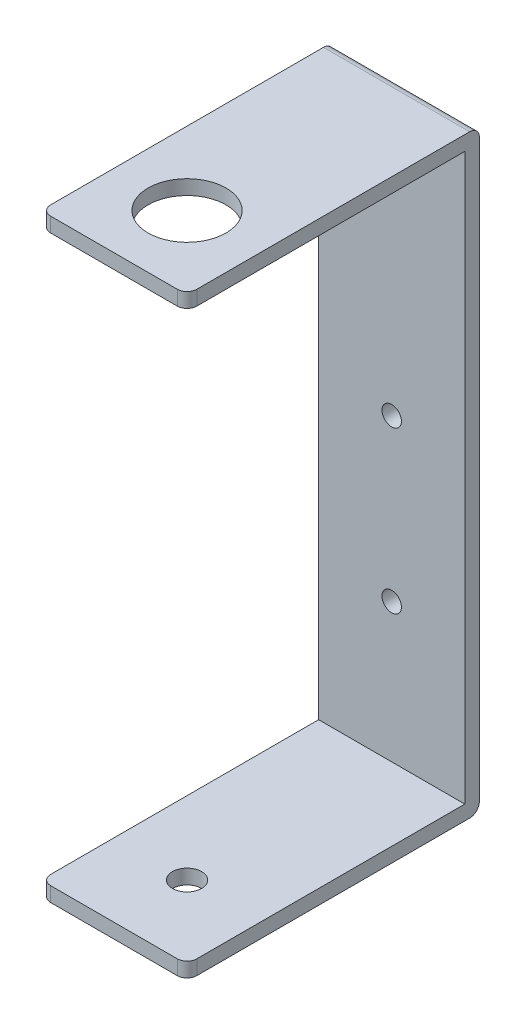
ISO-10303-21;
HEADER;
FILE_DESCRIPTION(('STEP AP214'),'2;1');
FILE_NAME('part.step','',(''),(''),'','','');
FILE_SCHEMA(('AUTOMOTIVE_DESIGN { 1 0 10303 214 1 1 1 1 }'));
ENDSEC;
DATA;
#1=APPLICATION_CONTEXT('core data for automotive mechanical design processes');
#2=APPLICATION_PROTOCOL_DEFINITION('international standard','automotive_design',2000,#1);
#3=PRODUCT_CONTEXT('',#1,'mechanical');
#4=PRODUCT('Part','Part','',(#3));
#5=PRODUCT_RELATED_PRODUCT_CATEGORY('part','',(#4));
#6=PRODUCT_DEFINITION_FORMATION('','',#4);
#7=PRODUCT_DEFINITION_CONTEXT('part definition',#1,'design');
#8=PRODUCT_DEFINITION('design','',#6,#7);
#9=PRODUCT_DEFINITION_SHAPE('','',#8);
#10=(LENGTH_UNIT() NAMED_UNIT(*) SI_UNIT(.MILLI.,.METRE.));
#11=(NAMED_UNIT(*) PLANE_ANGLE_UNIT() SI_UNIT($,.RADIAN.));
#12=(NAMED_UNIT(*) SI_UNIT($,.STERADIAN.) SOLID_ANGLE_UNIT());
#13=UNCERTAINTY_MEASURE_WITH_UNIT(LENGTH_MEASURE(1.E-05),#10,'distance_accuracy_value','');
#14=(GEOMETRIC_REPRESENTATION_CONTEXT(3) GLOBAL_UNCERTAINTY_ASSIGNED_CONTEXT((#13)) GLOBAL_UNIT_ASSIGNED_CONTEXT((#10,
#11,#12)) REPRESENTATION_CONTEXT('',''));
#15=CARTESIAN_POINT('',(0.,0.,0.));
#16=DIRECTION('',(0.,0.,1.));
#17=DIRECTION('',(1.,0.,0.));
#18=AXIS2_PLACEMENT_3D('',#15,#16,#17);
#19=CARTESIAN_POINT('',(0.,0.,1.5));
#20=DIRECTION('',(0.,0.,1.));
#21=DIRECTION('',(1.,0.,0.));
#22=AXIS2_PLACEMENT_3D('',#19,#20,#21);
#23=PLANE('',#22);
#24=CARTESIAN_POINT('',(0.,1.76200000000001,1.5));
#25=DIRECTION('',(0.,0.,1.));
#26=DIRECTION('',(1.,0.,0.));
#27=AXIS2_PLACEMENT_3D('',#24,#25,#26);
#28=CIRCLE('',#27,1.);
#29=CARTESIAN_POINT('',(1.,1.76200000000001,1.5));
#30=VERTEX_POINT('',#29);
#31=EDGE_CURVE('E257',#30,#30,#28,.T.);
#32=ORIENTED_EDGE('',*,*,#31,.F.);
#33=EDGE_LOOP('',(#32));
#34=FACE_BOUND('',#33,.T.);
#35=CARTESIAN_POINT('',(0.,-14.75,1.5));
#36=DIRECTION('',(0.,0.,1.));
#37=DIRECTION('',(1.,0.,0.));
#38=AXIS2_PLACEMENT_3D('',#35,#36,#37);
#39=CIRCLE('',#38,1.);
#40=CARTESIAN_POINT('',(1.,-14.75,1.5));
#41=VERTEX_POINT('',#40);
#42=EDGE_CURVE('E246',#41,#41,#39,.T.);
#43=ORIENTED_EDGE('',*,*,#42,.F.);
#44=EDGE_LOOP('',(#43));
#45=FACE_BOUND('',#44,.T.);
#46=DIRECTION('',(0.,1.,0.));
#47=VECTOR('',#46,1.);
#48=CARTESIAN_POINT('',(-7.5,0.,1.5));
#49=LINE('',#48,#47);
#50=CARTESIAN_POINT('',(-7.49999999999999,-29.,1.5));
#51=VERTEX_POINT('',#50);
#52=CARTESIAN_POINT('',(-7.5,29.,1.5));
#53=VERTEX_POINT('',#52);
#54=EDGE_CURVE('E161',#51,#53,#49,.T.);
#55=ORIENTED_EDGE('',*,*,#54,.F.);
#56=DIRECTION('',(-1.,0.,0.));
#57=VECTOR('',#56,1.);
#58=CARTESIAN_POINT('',(7.5,-29.,1.5));
#59=LINE('',#58,#57);
#60=CARTESIAN_POINT('',(7.5,-29.,1.5));
#61=VERTEX_POINT('',#60);
#62=EDGE_CURVE('E160',#61,#51,#59,.T.);
#63=ORIENTED_EDGE('',*,*,#62,.F.);
#64=DIRECTION('',(0.,1.,0.));
#65=VECTOR('',#64,1.);
#66=CARTESIAN_POINT('',(7.5,0.,1.5));
#67=LINE('',#66,#65);
#68=CARTESIAN_POINT('',(7.5,29.,1.5));
#69=VERTEX_POINT('',#68);
#70=EDGE_CURVE('E145',#61,#69,#67,.T.);
#71=ORIENTED_EDGE('',*,*,#70,.T.);
#72=DIRECTION('',(1.,0.,0.));
#73=VECTOR('',#72,1.);
#74=CARTESIAN_POINT('',(-7.49999999999999,29.,1.5));
#75=LINE('',#74,#73);
#76=EDGE_CURVE('E158',#53,#69,#75,.T.);
#77=ORIENTED_EDGE('',*,*,#76,.F.);
#78=EDGE_LOOP('',(#55,#63,#71,#77));
#79=FACE_BOUND('',#78,.T.);
#80=ADVANCED_FACE('F35',(#34,#45,#79),#23,.T.);
#81=CARTESIAN_POINT('',(0.,-30.5,1.5));
#82=DIRECTION('',(0.,1.,0.));
#83=DIRECTION('',(-1.,0.,0.));
#84=AXIS2_PLACEMENT_3D('',#81,#82,#83);
#85=PLANE('',#84);
#86=CARTESIAN_POINT('',(0.,-30.5,22.5));
#87=DIRECTION('',(0.,1.,0.));
#88=DIRECTION('',(0.,0.,1.));
#89=AXIS2_PLACEMENT_3D('',#86,#87,#88);
#90=CIRCLE('',#89,1.5);
#91=CARTESIAN_POINT('',(0.,-30.5,24.));
#92=VERTEX_POINT('',#91);
#93=EDGE_CURVE('E193',#92,#92,#90,.T.);
#94=ORIENTED_EDGE('',*,*,#93,.T.);
#95=EDGE_LOOP('',(#94));
#96=FACE_BOUND('',#95,.T.);
#97=DIRECTION('',(0.,0.,-1.));
#98=VECTOR('',#97,1.);
#99=CARTESIAN_POINT('',(-7.49999999999999,-30.5,1.5));
#100=LINE('',#99,#98);
#101=CARTESIAN_POINT('',(-7.49999999999999,-30.5,29.));
#102=VERTEX_POINT('',#101);
#103=CARTESIAN_POINT('',(-7.49999999999999,-30.5,1.));
#104=VERTEX_POINT('',#103);
#105=EDGE_CURVE('E279',#102,#104,#100,.T.);
#106=ORIENTED_EDGE('',*,*,#105,.T.);
#107=DIRECTION('',(1.,0.,0.));
#108=VECTOR('',#107,1.);
#109=CARTESIAN_POINT('',(0.,-30.5,1.));
#110=LINE('',#109,#108);
#111=CARTESIAN_POINT('',(7.5,-30.5,1.));
#112=VERTEX_POINT('',#111);
#113=EDGE_CURVE('E198',#104,#112,#110,.T.);
#114=ORIENTED_EDGE('',*,*,#113,.T.);
#115=DIRECTION('',(0.,0.,-1.));
#116=VECTOR('',#115,1.);
#117=CARTESIAN_POINT('',(7.5,-30.5,1.5));
#118=LINE('',#117,#116);
#119=CARTESIAN_POINT('',(7.5,-30.5,29.));
#120=VERTEX_POINT('',#119);
#121=EDGE_CURVE('E177',#120,#112,#118,.T.);
#122=ORIENTED_EDGE('',*,*,#121,.F.);
#123=CARTESIAN_POINT('',(6.5,-30.5,29.));
#124=DIRECTION('',(0.,1.,0.));
#125=DIRECTION('',(-1.,0.,0.));
#126=AXIS2_PLACEMENT_3D('',#123,#124,#125);
#127=CIRCLE('',#126,1.);
#128=CARTESIAN_POINT('',(6.5,-30.5,30.));
#129=VERTEX_POINT('',#128);
#130=EDGE_CURVE('E194',#120,#129,#127,.F.);
#131=ORIENTED_EDGE('',*,*,#130,.T.);
#132=DIRECTION('',(1.,0.,0.));
#133=VECTOR('',#132,1.);
#134=CARTESIAN_POINT('',(7.5,-30.5,30.));
#135=LINE('',#134,#133);
#136=CARTESIAN_POINT('',(-6.49999999999999,-30.5,30.));
#137=VERTEX_POINT('',#136);
#138=EDGE_CURVE('E267',#137,#129,#135,.T.);
#139=ORIENTED_EDGE('',*,*,#138,.F.);
#140=CARTESIAN_POINT('',(-6.49999999999999,-30.5,29.));
#141=DIRECTION('',(0.,1.,0.));
#142=DIRECTION('',(-1.,0.,0.));
#143=AXIS2_PLACEMENT_3D('',#140,#141,#142);
#144=CIRCLE('',#143,1.);
#145=EDGE_CURVE('E196',#137,#102,#144,.F.);
#146=ORIENTED_EDGE('',*,*,#145,.T.);
#147=EDGE_LOOP('',(#106,#114,#122,#131,#139,#146));
#148=FACE_BOUND('',#147,.T.);
#149=ADVANCED_FACE('F291',(#96,#148),#85,.F.);
#150=CARTESIAN_POINT('',(7.5,0.,1.5));
#151=DIRECTION('',(-1.,0.,0.));
#152=DIRECTION('',(0.,0.,1.));
#153=AXIS2_PLACEMENT_3D('',#150,#151,#152);
#154=PLANE('',#153);
#155=ORIENTED_EDGE('',*,*,#121,.T.);
#156=CARTESIAN_POINT('',(7.5,-29.5,1.));
#157=DIRECTION('',(-1.,0.,0.));
#158=DIRECTION('',(0.,0.,1.));
#159=AXIS2_PLACEMENT_3D('',#156,#157,#158);
#160=CIRCLE('',#159,1.);
#161=CARTESIAN_POINT('',(7.5,-29.5,0.));
#162=VERTEX_POINT('',#161);
#163=EDGE_CURVE('E206',#112,#162,#160,.F.);
#164=ORIENTED_EDGE('',*,*,#163,.T.);
#165=DIRECTION('',(0.,1.,0.));
#166=VECTOR('',#165,1.);
#167=CARTESIAN_POINT('',(7.5,0.,0.));
#168=LINE('',#167,#166);
#169=CARTESIAN_POINT('',(7.5,29.5,0.));
#170=VERTEX_POINT('',#169);
#171=EDGE_CURVE('E215',#162,#170,#168,.T.);
#172=ORIENTED_EDGE('',*,*,#171,.T.);
#173=CARTESIAN_POINT('',(7.5,29.5,1.));
#174=DIRECTION('',(-1.,0.,0.));
#175=DIRECTION('',(0.,0.,1.));
#176=AXIS2_PLACEMENT_3D('',#173,#174,#175);
#177=CIRCLE('',#176,1.);
#178=CARTESIAN_POINT('',(7.5,30.5,1.));
#179=VERTEX_POINT('',#178);
#180=EDGE_CURVE('E200',#170,#179,#177,.F.);
#181=ORIENTED_EDGE('',*,*,#180,.T.);
#182=DIRECTION('',(0.,0.,-1.));
#183=VECTOR('',#182,1.);
#184=CARTESIAN_POINT('',(7.5,30.5,1.5));
#185=LINE('',#184,#183);
#186=CARTESIAN_POINT('',(7.5,30.5,29.));
#187=VERTEX_POINT('',#186);
#188=EDGE_CURVE('E302',#187,#179,#185,.T.);
#189=ORIENTED_EDGE('',*,*,#188,.F.);
#190=DIRECTION('',(0.,1.,0.));
#191=VECTOR('',#190,1.);
#192=CARTESIAN_POINT('',(7.5,29.,29.));
#193=LINE('',#192,#191);
#194=CARTESIAN_POINT('',(7.5,29.,29.));
#195=VERTEX_POINT('',#194);
#196=EDGE_CURVE('E147',#187,#195,#193,.F.);
#197=ORIENTED_EDGE('',*,*,#196,.T.);
#198=DIRECTION('',(0.,0.,-1.));
#199=VECTOR('',#198,1.);
#200=CARTESIAN_POINT('',(7.5,29.,30.));
#201=LINE('',#200,#199);
#202=EDGE_CURVE('E140',#195,#69,#201,.T.);
#203=ORIENTED_EDGE('',*,*,#202,.T.);
#204=ORIENTED_EDGE('',*,*,#70,.F.);
#205=DIRECTION('',(0.,0.,-1.));
#206=VECTOR('',#205,1.);
#207=CARTESIAN_POINT('',(7.5,-29.,30.));
#208=LINE('',#207,#206);
#209=CARTESIAN_POINT('',(7.5,-29.,29.));
#210=VERTEX_POINT('',#209);
#211=EDGE_CURVE('E168',#210,#61,#208,.T.);
#212=ORIENTED_EDGE('',*,*,#211,.F.);
#213=DIRECTION('',(0.,1.,0.));
#214=VECTOR('',#213,1.);
#215=CARTESIAN_POINT('',(7.5,-30.5,29.));
#216=LINE('',#215,#214);
#217=EDGE_CURVE('E204',#210,#120,#216,.F.);
#218=ORIENTED_EDGE('',*,*,#217,.T.);
#219=EDGE_LOOP('',(#155,#164,#172,#181,#189,#197,#203,#204,#212,#218));
#220=FACE_BOUND('',#219,.T.);
#221=ADVANCED_FACE('F143',(#220),#154,.F.);
#222=CARTESIAN_POINT('',(0.,30.5,1.5));
#223=DIRECTION('',(0.,1.,0.));
#224=DIRECTION('',(0.,0.,1.));
#225=AXIS2_PLACEMENT_3D('',#222,#223,#224);
#226=PLANE('',#225);
#227=CARTESIAN_POINT('',(0.,30.5,22.5));
#228=DIRECTION('',(0.,1.,0.));
#229=DIRECTION('',(0.,0.,1.));
#230=AXIS2_PLACEMENT_3D('',#227,#228,#229);
#231=CIRCLE('',#230,4.);
#232=CARTESIAN_POINT('',(0.,30.5,26.5));
#233=VERTEX_POINT('',#232);
#234=EDGE_CURVE('E245',#233,#233,#231,.T.);
#235=ORIENTED_EDGE('',*,*,#234,.F.);
#236=EDGE_LOOP('',(#235));
#237=FACE_BOUND('',#236,.T.);
#238=DIRECTION('',(-1.,0.,0.));
#239=VECTOR('',#238,1.);
#240=CARTESIAN_POINT('',(-7.5,30.5,30.));
#241=LINE('',#240,#239);
#242=CARTESIAN_POINT('',(6.49999999999999,30.5,30.));
#243=VERTEX_POINT('',#242);
#244=CARTESIAN_POINT('',(-6.5,30.5,30.));
#245=VERTEX_POINT('',#244);
#246=EDGE_CURVE('E152',#243,#245,#241,.T.);
#247=ORIENTED_EDGE('',*,*,#246,.F.);
#248=CARTESIAN_POINT('',(6.5,30.5,29.));
#249=DIRECTION('',(0.,1.,0.));
#250=DIRECTION('',(0.,0.,1.));
#251=AXIS2_PLACEMENT_3D('',#248,#249,#250);
#252=CIRCLE('',#251,1.);
#253=EDGE_CURVE('E60',#243,#187,#252,.T.);
#254=ORIENTED_EDGE('',*,*,#253,.T.);
#255=ORIENTED_EDGE('',*,*,#188,.T.);
#256=DIRECTION('',(1.,0.,0.));
#257=VECTOR('',#256,1.);
#258=CARTESIAN_POINT('',(-7.5,30.5,1.));
#259=LINE('',#258,#257);
#260=CARTESIAN_POINT('',(-7.5,30.5,1.));
#261=VERTEX_POINT('',#260);
#262=EDGE_CURVE('E239',#179,#261,#259,.F.);
#263=ORIENTED_EDGE('',*,*,#262,.T.);
#264=DIRECTION('',(0.,0.,-1.));
#265=VECTOR('',#264,1.);
#266=CARTESIAN_POINT('',(-7.5,30.5,1.5));
#267=LINE('',#266,#265);
#268=CARTESIAN_POINT('',(-7.5,30.5,29.));
#269=VERTEX_POINT('',#268);
#270=EDGE_CURVE('E299',#269,#261,#267,.T.);
#271=ORIENTED_EDGE('',*,*,#270,.F.);
#272=CARTESIAN_POINT('',(-6.5,30.5,29.));
#273=DIRECTION('',(0.,1.,0.));
#274=DIRECTION('',(0.,0.,1.));
#275=AXIS2_PLACEMENT_3D('',#272,#273,#274);
#276=CIRCLE('',#275,1.);
#277=EDGE_CURVE('E52',#269,#245,#276,.T.);
#278=ORIENTED_EDGE('',*,*,#277,.T.);
#279=EDGE_LOOP('',(#247,#254,#255,#263,#271,#278));
#280=FACE_BOUND('',#279,.T.);
#281=ADVANCED_FACE('F344',(#237,#280),#226,.T.);
#282=CARTESIAN_POINT('',(-7.5,0.,1.5));
#283=DIRECTION('',(-1.,0.,0.));
#284=DIRECTION('',(0.,-1.,0.));
#285=AXIS2_PLACEMENT_3D('',#282,#283,#284);
#286=PLANE('',#285);
#287=DIRECTION('',(0.,1.,0.));
#288=VECTOR('',#287,1.);
#289=CARTESIAN_POINT('',(-7.5,0.,0.));
#290=LINE('',#289,#288);
#291=CARTESIAN_POINT('',(-7.49999999999999,-29.5,0.));
#292=VERTEX_POINT('',#291);
#293=CARTESIAN_POINT('',(-7.5,29.5,0.));
#294=VERTEX_POINT('',#293);
#295=EDGE_CURVE('E162',#292,#294,#290,.T.);
#296=ORIENTED_EDGE('',*,*,#295,.F.);
#297=CARTESIAN_POINT('',(-7.49999999999999,-29.5,1.));
#298=DIRECTION('',(-1.,0.,0.));
#299=DIRECTION('',(0.,-1.,0.));
#300=AXIS2_PLACEMENT_3D('',#297,#298,#299);
#301=CIRCLE('',#300,1.);
#302=EDGE_CURVE('E222',#292,#104,#301,.T.);
#303=ORIENTED_EDGE('',*,*,#302,.T.);
#304=ORIENTED_EDGE('',*,*,#105,.F.);
#305=DIRECTION('',(0.,-1.,0.));
#306=VECTOR('',#305,1.);
#307=CARTESIAN_POINT('',(-7.5,0.,29.));
#308=LINE('',#307,#306);
#309=CARTESIAN_POINT('',(-7.49999999999999,-29.,29.));
#310=VERTEX_POINT('',#309);
#311=EDGE_CURVE('E220',#102,#310,#308,.F.);
#312=ORIENTED_EDGE('',*,*,#311,.T.);
#313=DIRECTION('',(0.,0.,-1.));
#314=VECTOR('',#313,1.);
#315=CARTESIAN_POINT('',(-7.49999999999999,-29.,30.));
#316=LINE('',#315,#314);
#317=EDGE_CURVE('E172',#310,#51,#316,.T.);
#318=ORIENTED_EDGE('',*,*,#317,.T.);
#319=ORIENTED_EDGE('',*,*,#54,.T.);
#320=DIRECTION('',(0.,0.,-1.));
#321=VECTOR('',#320,1.);
#322=CARTESIAN_POINT('',(-7.49999999999999,29.,30.));
#323=LINE('',#322,#321);
#324=CARTESIAN_POINT('',(-7.49999999999999,29.,29.));
#325=VERTEX_POINT('',#324);
#326=EDGE_CURVE('E151',#325,#53,#323,.T.);
#327=ORIENTED_EDGE('',*,*,#326,.F.);
#328=DIRECTION('',(0.,-1.,0.));
#329=VECTOR('',#328,1.);
#330=CARTESIAN_POINT('',(-7.5,0.,29.));
#331=LINE('',#330,#329);
#332=EDGE_CURVE('E218',#325,#269,#331,.F.);
#333=ORIENTED_EDGE('',*,*,#332,.T.);
#334=ORIENTED_EDGE('',*,*,#270,.T.);
#335=CARTESIAN_POINT('',(-7.5,29.5,1.));
#336=DIRECTION('',(-1.,0.,0.));
#337=DIRECTION('',(0.,-1.,0.));
#338=AXIS2_PLACEMENT_3D('',#335,#336,#337);
#339=CIRCLE('',#338,1.);
#340=EDGE_CURVE('E213',#261,#294,#339,.T.);
#341=ORIENTED_EDGE('',*,*,#340,.T.);
#342=EDGE_LOOP('',(#296,#303,#304,#312,#318,#319,#327,#333,#334,#341));
#343=FACE_BOUND('',#342,.T.);
#344=ADVANCED_FACE('F274',(#343),#286,.T.);
#345=CARTESIAN_POINT('',(0.,0.,0.));
#346=DIRECTION('',(0.,0.,1.));
#347=DIRECTION('',(1.,0.,0.));
#348=AXIS2_PLACEMENT_3D('',#345,#346,#347);
#349=PLANE('',#348);
#350=CARTESIAN_POINT('',(0.,1.76200000000001,0.));
#351=DIRECTION('',(0.,0.,1.));
#352=DIRECTION('',(1.,0.,0.));
#353=AXIS2_PLACEMENT_3D('',#350,#351,#352);
#354=CIRCLE('',#353,1.);
#355=CARTESIAN_POINT('',(1.,1.76200000000001,0.));
#356=VERTEX_POINT('',#355);
#357=EDGE_CURVE('E39',#356,#356,#354,.T.);
#358=ORIENTED_EDGE('',*,*,#357,.T.);
#359=EDGE_LOOP('',(#358));
#360=FACE_BOUND('',#359,.T.);
#361=CARTESIAN_POINT('',(0.,-14.75,0.));
#362=DIRECTION('',(0.,0.,1.));
#363=DIRECTION('',(1.,0.,0.));
#364=AXIS2_PLACEMENT_3D('',#361,#362,#363);
#365=CIRCLE('',#364,1.);
#366=CARTESIAN_POINT('',(1.,-14.75,0.));
#367=VERTEX_POINT('',#366);
#368=EDGE_CURVE('E243',#367,#367,#365,.T.);
#369=ORIENTED_EDGE('',*,*,#368,.T.);
#370=EDGE_LOOP('',(#369));
#371=FACE_BOUND('',#370,.T.);
#372=ORIENTED_EDGE('',*,*,#171,.F.);
#373=DIRECTION('',(1.,0.,0.));
#374=VECTOR('',#373,1.);
#375=CARTESIAN_POINT('',(0.,-29.5,0.));
#376=LINE('',#375,#374);
#377=EDGE_CURVE('E211',#162,#292,#376,.F.);
#378=ORIENTED_EDGE('',*,*,#377,.T.);
#379=ORIENTED_EDGE('',*,*,#295,.T.);
#380=DIRECTION('',(1.,0.,0.));
#381=VECTOR('',#380,1.);
#382=CARTESIAN_POINT('',(7.5,29.5,0.));
#383=LINE('',#382,#381);
#384=EDGE_CURVE('E208',#294,#170,#383,.T.);
#385=ORIENTED_EDGE('',*,*,#384,.T.);
#386=EDGE_LOOP('',(#372,#378,#379,#385));
#387=FACE_BOUND('',#386,.T.);
#388=ADVANCED_FACE('F312',(#360,#371,#387),#349,.F.);
#389=CARTESIAN_POINT('',(-7.49999999999999,29.,30.));
#390=DIRECTION('',(0.,1.,0.));
#391=DIRECTION('',(-1.,0.,0.));
#392=AXIS2_PLACEMENT_3D('',#389,#390,#391);
#393=PLANE('',#392);
#394=CARTESIAN_POINT('',(0.,29.,22.5));
#395=DIRECTION('',(0.,1.,0.));
#396=DIRECTION('',(-1.,0.,0.));
#397=AXIS2_PLACEMENT_3D('',#394,#395,#396);
#398=CIRCLE('',#397,4.);
#399=CARTESIAN_POINT('',(-4.,29.,22.5));
#400=VERTEX_POINT('',#399);
#401=EDGE_CURVE('E250',#400,#400,#398,.F.);
#402=ORIENTED_EDGE('',*,*,#401,.F.);
#403=EDGE_LOOP('',(#402));
#404=FACE_BOUND('',#403,.T.);
#405=ORIENTED_EDGE('',*,*,#202,.F.);
#406=CARTESIAN_POINT('',(6.5,29.,29.));
#407=DIRECTION('',(0.,1.,0.));
#408=DIRECTION('',(-1.,0.,0.));
#409=AXIS2_PLACEMENT_3D('',#406,#407,#408);
#410=CIRCLE('',#409,1.);
#411=CARTESIAN_POINT('',(6.5,29.,30.));
#412=VERTEX_POINT('',#411);
#413=EDGE_CURVE('E11',#195,#412,#410,.F.);
#414=ORIENTED_EDGE('',*,*,#413,.T.);
#415=DIRECTION('',(1.,0.,0.));
#416=VECTOR('',#415,1.);
#417=CARTESIAN_POINT('',(-7.49999999999999,29.,30.));
#418=LINE('',#417,#416);
#419=CARTESIAN_POINT('',(-6.5,29.,30.));
#420=VERTEX_POINT('',#419);
#421=EDGE_CURVE('E167',#420,#412,#418,.T.);
#422=ORIENTED_EDGE('',*,*,#421,.F.);
#423=CARTESIAN_POINT('',(-6.5,29.,29.));
#424=DIRECTION('',(0.,1.,0.));
#425=DIRECTION('',(-1.,0.,0.));
#426=AXIS2_PLACEMENT_3D('',#423,#424,#425);
#427=CIRCLE('',#426,1.);
#428=EDGE_CURVE('E44',#420,#325,#427,.F.);
#429=ORIENTED_EDGE('',*,*,#428,.T.);
#430=ORIENTED_EDGE('',*,*,#326,.T.);
#431=ORIENTED_EDGE('',*,*,#76,.T.);
#432=EDGE_LOOP('',(#405,#414,#422,#429,#430,#431));
#433=FACE_BOUND('',#432,.T.);
#434=ADVANCED_FACE('F164',(#404,#433),#393,.F.);
#435=CARTESIAN_POINT('',(0.,0.,30.));
#436=DIRECTION('',(0.,0.,1.));
#437=DIRECTION('',(1.,0.,0.));
#438=AXIS2_PLACEMENT_3D('',#435,#436,#437);
#439=PLANE('',#438);
#440=ORIENTED_EDGE('',*,*,#421,.T.);
#441=DIRECTION('',(0.,1.,0.));
#442=VECTOR('',#441,1.);
#443=CARTESIAN_POINT('',(6.5,30.5,30.));
#444=LINE('',#443,#442);
#445=EDGE_CURVE('E237',#412,#243,#444,.T.);
#446=ORIENTED_EDGE('',*,*,#445,.T.);
#447=ORIENTED_EDGE('',*,*,#246,.T.);
#448=DIRECTION('',(0.,-1.,0.));
#449=VECTOR('',#448,1.);
#450=CARTESIAN_POINT('',(-6.5,0.,30.));
#451=LINE('',#450,#449);
#452=EDGE_CURVE('E234',#245,#420,#451,.T.);
#453=ORIENTED_EDGE('',*,*,#452,.T.);
#454=EDGE_LOOP('',(#440,#446,#447,#453));
#455=FACE_BOUND('',#454,.T.);
#456=ADVANCED_FACE('F374',(#455),#439,.T.);
#457=CARTESIAN_POINT('',(7.5,-29.,30.));
#458=DIRECTION('',(0.,-1.,0.));
#459=DIRECTION('',(1.,0.,0.));
#460=AXIS2_PLACEMENT_3D('',#457,#458,#459);
#461=PLANE('',#460);
#462=CARTESIAN_POINT('',(0.,-29.,22.5));
#463=DIRECTION('',(0.,-1.,0.));
#464=DIRECTION('',(1.,0.,0.));
#465=AXIS2_PLACEMENT_3D('',#462,#463,#464);
#466=CIRCLE('',#465,1.5);
#467=CARTESIAN_POINT('',(1.5,-29.,22.5));
#468=VERTEX_POINT('',#467);
#469=EDGE_CURVE('E190',#468,#468,#466,.T.);
#470=ORIENTED_EDGE('',*,*,#469,.T.);
#471=EDGE_LOOP('',(#470));
#472=FACE_BOUND('',#471,.T.);
#473=ORIENTED_EDGE('',*,*,#317,.F.);
#474=CARTESIAN_POINT('',(-6.49999999999999,-29.,29.));
#475=DIRECTION('',(0.,-1.,0.));
#476=DIRECTION('',(1.,0.,0.));
#477=AXIS2_PLACEMENT_3D('',#474,#475,#476);
#478=CIRCLE('',#477,1.);
#479=CARTESIAN_POINT('',(-6.49999999999999,-29.,30.));
#480=VERTEX_POINT('',#479);
#481=EDGE_CURVE('E232',#310,#480,#478,.F.);
#482=ORIENTED_EDGE('',*,*,#481,.T.);
#483=DIRECTION('',(-1.,0.,0.));
#484=VECTOR('',#483,1.);
#485=CARTESIAN_POINT('',(7.5,-29.,30.));
#486=LINE('',#485,#484);
#487=CARTESIAN_POINT('',(6.5,-29.,30.));
#488=VERTEX_POINT('',#487);
#489=EDGE_CURVE('E264',#488,#480,#486,.T.);
#490=ORIENTED_EDGE('',*,*,#489,.F.);
#491=CARTESIAN_POINT('',(6.5,-29.,29.));
#492=DIRECTION('',(0.,-1.,0.));
#493=DIRECTION('',(1.,0.,0.));
#494=AXIS2_PLACEMENT_3D('',#491,#492,#493);
#495=CIRCLE('',#494,1.);
#496=EDGE_CURVE('E230',#488,#210,#495,.F.);
#497=ORIENTED_EDGE('',*,*,#496,.T.);
#498=ORIENTED_EDGE('',*,*,#211,.T.);
#499=ORIENTED_EDGE('',*,*,#62,.T.);
#500=EDGE_LOOP('',(#473,#482,#490,#497,#498,#499));
#501=FACE_BOUND('',#500,.T.);
#502=ADVANCED_FACE('F280',(#472,#501),#461,.F.);
#503=CARTESIAN_POINT('',(0.,0.,30.));
#504=DIRECTION('',(0.,0.,1.));
#505=DIRECTION('',(1.,0.,0.));
#506=AXIS2_PLACEMENT_3D('',#503,#504,#505);
#507=PLANE('',#506);
#508=ORIENTED_EDGE('',*,*,#489,.T.);
#509=DIRECTION('',(0.,-1.,0.));
#510=VECTOR('',#509,1.);
#511=CARTESIAN_POINT('',(-6.5,0.,30.));
#512=LINE('',#511,#510);
#513=EDGE_CURVE('E227',#480,#137,#512,.T.);
#514=ORIENTED_EDGE('',*,*,#513,.T.);
#515=ORIENTED_EDGE('',*,*,#138,.T.);
#516=DIRECTION('',(0.,1.,0.));
#517=VECTOR('',#516,1.);
#518=CARTESIAN_POINT('',(6.5,-29.,30.));
#519=LINE('',#518,#517);
#520=EDGE_CURVE('E224',#129,#488,#519,.T.);
#521=ORIENTED_EDGE('',*,*,#520,.T.);
#522=EDGE_LOOP('',(#508,#514,#515,#521));
#523=FACE_BOUND('',#522,.T.);
#524=ADVANCED_FACE('F293',(#523),#507,.T.);
#525=CARTESIAN_POINT('',(0.,-30.5,22.5));
#526=DIRECTION('',(0.,1.,0.));
#527=DIRECTION('',(0.,0.,1.));
#528=AXIS2_PLACEMENT_3D('',#525,#526,#527);
#529=CYLINDRICAL_SURFACE('',#528,1.5);
#530=ORIENTED_EDGE('',*,*,#93,.F.);
#531=EDGE_LOOP('',(#530));
#532=FACE_BOUND('',#531,.T.);
#533=ORIENTED_EDGE('',*,*,#469,.F.);
#534=EDGE_LOOP('',(#533));
#535=FACE_BOUND('',#534,.T.);
#536=ADVANCED_FACE('F317',(#532,#535),#529,.F.);
#537=CARTESIAN_POINT('',(0.,-29.5,1.));
#538=DIRECTION('',(1.,0.,0.));
#539=DIRECTION('',(0.,1.,0.));
#540=AXIS2_PLACEMENT_3D('',#537,#538,#539);
#541=CYLINDRICAL_SURFACE('',#540,1.);
#542=ORIENTED_EDGE('',*,*,#302,.F.);
#543=ORIENTED_EDGE('',*,*,#377,.F.);
#544=ORIENTED_EDGE('',*,*,#163,.F.);
#545=ORIENTED_EDGE('',*,*,#113,.F.);
#546=EDGE_LOOP('',(#542,#543,#544,#545));
#547=FACE_BOUND('',#546,.T.);
#548=ADVANCED_FACE('F315',(#547),#541,.T.);
#549=CARTESIAN_POINT('',(-6.5,0.,29.));
#550=DIRECTION('',(0.,-1.,0.));
#551=DIRECTION('',(1.,0.,0.));
#552=AXIS2_PLACEMENT_3D('',#549,#550,#551);
#553=CYLINDRICAL_SURFACE('',#552,1.);
#554=ORIENTED_EDGE('',*,*,#481,.F.);
#555=ORIENTED_EDGE('',*,*,#311,.F.);
#556=ORIENTED_EDGE('',*,*,#145,.F.);
#557=ORIENTED_EDGE('',*,*,#513,.F.);
#558=EDGE_LOOP('',(#554,#555,#556,#557));
#559=FACE_BOUND('',#558,.T.);
#560=ADVANCED_FACE('F296',(#559),#553,.T.);
#561=CARTESIAN_POINT('',(6.5,0.,29.));
#562=DIRECTION('',(0.,-1.,0.));
#563=DIRECTION('',(0.,0.,-1.));
#564=AXIS2_PLACEMENT_3D('',#561,#562,#563);
#565=CYLINDRICAL_SURFACE('',#564,1.);
#566=ORIENTED_EDGE('',*,*,#130,.F.);
#567=ORIENTED_EDGE('',*,*,#217,.F.);
#568=ORIENTED_EDGE('',*,*,#496,.F.);
#569=ORIENTED_EDGE('',*,*,#520,.F.);
#570=EDGE_LOOP('',(#566,#567,#568,#569));
#571=FACE_BOUND('',#570,.T.);
#572=ADVANCED_FACE('F286',(#571),#565,.T.);
#573=CARTESIAN_POINT('',(6.5,0.,29.));
#574=DIRECTION('',(0.,-1.,0.));
#575=DIRECTION('',(0.,0.,-1.));
#576=AXIS2_PLACEMENT_3D('',#573,#574,#575);
#577=CYLINDRICAL_SURFACE('',#576,1.);
#578=ORIENTED_EDGE('',*,*,#413,.F.);
#579=ORIENTED_EDGE('',*,*,#196,.F.);
#580=ORIENTED_EDGE('',*,*,#253,.F.);
#581=ORIENTED_EDGE('',*,*,#445,.F.);
#582=EDGE_LOOP('',(#578,#579,#580,#581));
#583=FACE_BOUND('',#582,.T.);
#584=ADVANCED_FACE('F502',(#583),#577,.T.);
#585=CARTESIAN_POINT('',(-6.5,0.,29.));
#586=DIRECTION('',(0.,-1.,0.));
#587=DIRECTION('',(1.,0.,0.));
#588=AXIS2_PLACEMENT_3D('',#585,#586,#587);
#589=CYLINDRICAL_SURFACE('',#588,1.);
#590=ORIENTED_EDGE('',*,*,#277,.F.);
#591=ORIENTED_EDGE('',*,*,#332,.F.);
#592=ORIENTED_EDGE('',*,*,#428,.F.);
#593=ORIENTED_EDGE('',*,*,#452,.F.);
#594=EDGE_LOOP('',(#590,#591,#592,#593));
#595=FACE_BOUND('',#594,.T.);
#596=ADVANCED_FACE('F496',(#595),#589,.T.);
#597=CARTESIAN_POINT('',(0.,29.5,1.));
#598=DIRECTION('',(-1.,0.,0.));
#599=DIRECTION('',(0.,0.,1.));
#600=AXIS2_PLACEMENT_3D('',#597,#598,#599);
#601=CYLINDRICAL_SURFACE('',#600,1.);
#602=ORIENTED_EDGE('',*,*,#340,.F.);
#603=ORIENTED_EDGE('',*,*,#262,.F.);
#604=ORIENTED_EDGE('',*,*,#180,.F.);
#605=ORIENTED_EDGE('',*,*,#384,.F.);
#606=EDGE_LOOP('',(#602,#603,#604,#605));
#607=FACE_BOUND('',#606,.T.);
#608=ADVANCED_FACE('F37',(#607),#601,.T.);
#609=CARTESIAN_POINT('',(0.,-30.501,22.5));
#610=DIRECTION('',(0.,1.,0.));
#611=DIRECTION('',(0.,0.,1.));
#612=AXIS2_PLACEMENT_3D('',#609,#610,#611);
#613=CYLINDRICAL_SURFACE('',#612,4.);
#614=ORIENTED_EDGE('',*,*,#234,.T.);
#615=EDGE_LOOP('',(#614));
#616=FACE_BOUND('',#615,.T.);
#617=ORIENTED_EDGE('',*,*,#401,.T.);
#618=EDGE_LOOP('',(#617));
#619=FACE_BOUND('',#618,.T.);
#620=ADVANCED_FACE('F461',(#616,#619),#613,.F.);
#621=CARTESIAN_POINT('',(0.,-14.75,-8.5));
#622=DIRECTION('',(0.,0.,1.));
#623=DIRECTION('',(1.,0.,0.));
#624=AXIS2_PLACEMENT_3D('',#621,#622,#623);
#625=CYLINDRICAL_SURFACE('',#624,1.);
#626=ORIENTED_EDGE('',*,*,#42,.T.);
#627=EDGE_LOOP('',(#626));
#628=FACE_BOUND('',#627,.T.);
#629=ORIENTED_EDGE('',*,*,#368,.F.);
#630=EDGE_LOOP('',(#629));
#631=FACE_BOUND('',#630,.T.);
#632=ADVANCED_FACE('F465',(#628,#631),#625,.F.);
#633=CARTESIAN_POINT('',(0.,1.76200000000001,-8.5));
#634=DIRECTION('',(0.,0.,1.));
#635=DIRECTION('',(1.,0.,0.));
#636=AXIS2_PLACEMENT_3D('',#633,#634,#635);
#637=CYLINDRICAL_SURFACE('',#636,1.);
#638=ORIENTED_EDGE('',*,*,#31,.T.);
#639=EDGE_LOOP('',(#638));
#640=FACE_BOUND('',#639,.T.);
#641=ORIENTED_EDGE('',*,*,#357,.F.);
#642=EDGE_LOOP('',(#641));
#643=FACE_BOUND('',#642,.T.);
#644=ADVANCED_FACE('F479',(#640,#643),#637,.F.);
#645=CLOSED_SHELL('',(#80,#149,#221,#281,#344,#388,#434,#456,#502,#524,#536,#548,#560,#572,#584,
#596,#608,#620,#632,#644));
#646=MANIFOLD_SOLID_BREP('B2',#645);
#647=ADVANCED_BREP_SHAPE_REPRESENTATION('',(#18,#646),#14);
#648=SHAPE_DEFINITION_REPRESENTATION(#9,#647);
ENDSEC;
END-ISO-10303-21;
